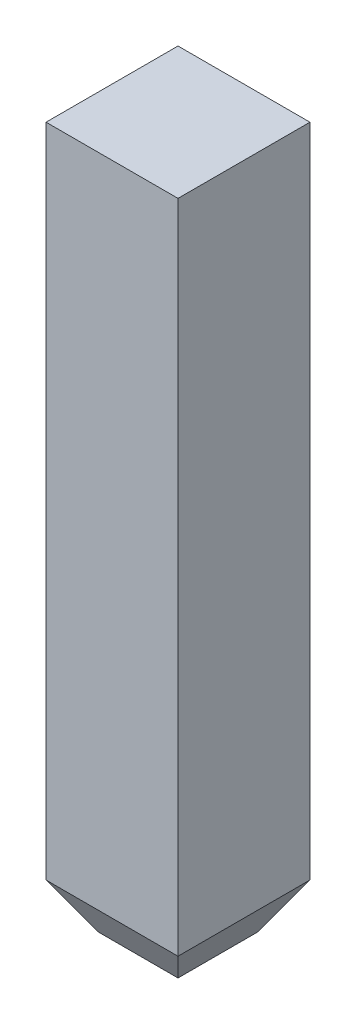
ISO-10303-21;
HEADER;
FILE_DESCRIPTION(('STEP AP214'),'2;1');
FILE_NAME('part.step','',(''),(''),'','','');
FILE_SCHEMA(('AUTOMOTIVE_DESIGN { 1 0 10303 214 1 1 1 1 }'));
ENDSEC;
DATA;
#1=APPLICATION_CONTEXT('core data for automotive mechanical design processes');
#2=APPLICATION_PROTOCOL_DEFINITION('international standard','automotive_design',2000,#1);
#3=PRODUCT_CONTEXT('',#1,'mechanical');
#4=PRODUCT('Part','Part','',(#3));
#5=PRODUCT_RELATED_PRODUCT_CATEGORY('part','',(#4));
#6=PRODUCT_DEFINITION_FORMATION('','',#4);
#7=PRODUCT_DEFINITION_CONTEXT('part definition',#1,'design');
#8=PRODUCT_DEFINITION('design','',#6,#7);
#9=PRODUCT_DEFINITION_SHAPE('','',#8);
#10=(LENGTH_UNIT() NAMED_UNIT(*) SI_UNIT(.MILLI.,.METRE.));
#11=(NAMED_UNIT(*) PLANE_ANGLE_UNIT() SI_UNIT($,.RADIAN.));
#12=(NAMED_UNIT(*) SI_UNIT($,.STERADIAN.) SOLID_ANGLE_UNIT());
#13=UNCERTAINTY_MEASURE_WITH_UNIT(LENGTH_MEASURE(1.E-05),#10,'distance_accuracy_value','');
#14=(GEOMETRIC_REPRESENTATION_CONTEXT(3) GLOBAL_UNCERTAINTY_ASSIGNED_CONTEXT((#13)) GLOBAL_UNIT_ASSIGNED_CONTEXT((#10,
#11,#12)) REPRESENTATION_CONTEXT('',''));
#15=CARTESIAN_POINT('',(0.,0.,0.));
#16=DIRECTION('',(0.,0.,1.));
#17=DIRECTION('',(1.,0.,0.));
#18=AXIS2_PLACEMENT_3D('',#15,#16,#17);
#19=CARTESIAN_POINT('',(-0.929999999999999,-3.4,0.82));
#20=DIRECTION('',(-1.,0.,0.));
#21=DIRECTION('',(0.,0.,1.));
#22=AXIS2_PLACEMENT_3D('',#19,#20,#21);
#23=PLANE('',#22);
#24=DIRECTION('',(0.,1.,0.));
#25=VECTOR('',#24,1.);
#26=CARTESIAN_POINT('',(-0.929999999999999,-3.4,0.82));
#27=LINE('',#26,#25);
#28=CARTESIAN_POINT('',(-0.929999999999999,-3.18349364905389,0.82));
#29=VERTEX_POINT('',#28);
#30=CARTESIAN_POINT('',(-0.929999999999999,0.,0.82));
#31=VERTEX_POINT('',#30);
#32=EDGE_CURVE('E11',#29,#31,#27,.T.);
#33=ORIENTED_EDGE('',*,*,#32,.F.);
#34=DIRECTION('',(0.,0.,-1.));
#35=VECTOR('',#34,1.);
#36=CARTESIAN_POINT('',(-0.929999999999999,-3.18349364905389,0.82));
#37=LINE('',#36,#35);
#38=CARTESIAN_POINT('',(-0.93,-3.18349364905389,0.18));
#39=VERTEX_POINT('',#38);
#40=EDGE_CURVE('E23',#29,#39,#37,.T.);
#41=ORIENTED_EDGE('',*,*,#40,.T.);
#42=DIRECTION('',(0.,1.,0.));
#43=VECTOR('',#42,1.);
#44=CARTESIAN_POINT('',(-0.93,-3.4,0.18));
#45=LINE('',#44,#43);
#46=CARTESIAN_POINT('',(-0.93,0.,0.18));
#47=VERTEX_POINT('',#46);
#48=EDGE_CURVE('E116',#39,#47,#45,.T.);
#49=ORIENTED_EDGE('',*,*,#48,.T.);
#50=DIRECTION('',(0.,0.,1.));
#51=VECTOR('',#50,1.);
#52=CARTESIAN_POINT('',(-0.929999999999999,0.,0.82));
#53=LINE('',#52,#51);
#54=EDGE_CURVE('E114',#47,#31,#53,.T.);
#55=ORIENTED_EDGE('',*,*,#54,.T.);
#56=EDGE_LOOP('',(#33,#41,#49,#55));
#57=FACE_BOUND('',#56,.T.);
#58=ADVANCED_FACE('F16',(#57),#23,.F.);
#59=CARTESIAN_POINT('',(-1.57,-3.4,0.82));
#60=DIRECTION('',(0.,0.,-1.));
#61=DIRECTION('',(-1.,0.,0.));
#62=AXIS2_PLACEMENT_3D('',#59,#60,#61);
#63=PLANE('',#62);
#64=DIRECTION('',(0.,1.,0.));
#65=VECTOR('',#64,1.);
#66=CARTESIAN_POINT('',(-1.57,-3.4,0.82));
#67=LINE('',#66,#65);
#68=CARTESIAN_POINT('',(-1.57,-3.18349364905389,0.82));
#69=VERTEX_POINT('',#68);
#70=CARTESIAN_POINT('',(-1.57,0.,0.82));
#71=VERTEX_POINT('',#70);
#72=EDGE_CURVE('E112',#69,#71,#67,.T.);
#73=ORIENTED_EDGE('',*,*,#72,.F.);
#74=DIRECTION('',(1.,0.,0.));
#75=VECTOR('',#74,1.);
#76=CARTESIAN_POINT('',(-1.57,-3.18349364905389,0.82));
#77=LINE('',#76,#75);
#78=EDGE_CURVE('E110',#69,#29,#77,.T.);
#79=ORIENTED_EDGE('',*,*,#78,.T.);
#80=ORIENTED_EDGE('',*,*,#32,.T.);
#81=DIRECTION('',(-1.,0.,0.));
#82=VECTOR('',#81,1.);
#83=CARTESIAN_POINT('',(-1.57,0.,0.82));
#84=LINE('',#83,#82);
#85=EDGE_CURVE('E108',#31,#71,#84,.T.);
#86=ORIENTED_EDGE('',*,*,#85,.T.);
#87=EDGE_LOOP('',(#73,#79,#80,#86));
#88=FACE_BOUND('',#87,.T.);
#89=ADVANCED_FACE('F138',(#88),#63,.F.);
#90=CARTESIAN_POINT('',(-1.57,-3.4,0.18));
#91=DIRECTION('',(1.,0.,0.));
#92=DIRECTION('',(0.,0.,-1.));
#93=AXIS2_PLACEMENT_3D('',#90,#91,#92);
#94=PLANE('',#93);
#95=DIRECTION('',(0.,1.,0.));
#96=VECTOR('',#95,1.);
#97=CARTESIAN_POINT('',(-1.57,-3.4,0.18));
#98=LINE('',#97,#96);
#99=CARTESIAN_POINT('',(-1.57,-3.18349364905389,0.18));
#100=VERTEX_POINT('',#99);
#101=CARTESIAN_POINT('',(-1.57,0.,0.18));
#102=VERTEX_POINT('',#101);
#103=EDGE_CURVE('E106',#100,#102,#98,.T.);
#104=ORIENTED_EDGE('',*,*,#103,.F.);
#105=DIRECTION('',(0.,0.,1.));
#106=VECTOR('',#105,1.);
#107=CARTESIAN_POINT('',(-1.57,-3.18349364905389,0.18));
#108=LINE('',#107,#106);
#109=EDGE_CURVE('E103',#100,#69,#108,.T.);
#110=ORIENTED_EDGE('',*,*,#109,.T.);
#111=ORIENTED_EDGE('',*,*,#72,.T.);
#112=DIRECTION('',(0.,0.,-1.));
#113=VECTOR('',#112,1.);
#114=CARTESIAN_POINT('',(-1.57,0.,0.18));
#115=LINE('',#114,#113);
#116=EDGE_CURVE('E100',#71,#102,#115,.T.);
#117=ORIENTED_EDGE('',*,*,#116,.T.);
#118=EDGE_LOOP('',(#104,#110,#111,#117));
#119=FACE_BOUND('',#118,.T.);
#120=ADVANCED_FACE('F133',(#119),#94,.F.);
#121=CARTESIAN_POINT('',(-0.93,-3.4,0.18));
#122=DIRECTION('',(0.,0.,1.));
#123=DIRECTION('',(1.,0.,0.));
#124=AXIS2_PLACEMENT_3D('',#121,#122,#123);
#125=PLANE('',#124);
#126=ORIENTED_EDGE('',*,*,#48,.F.);
#127=DIRECTION('',(-1.,0.,0.));
#128=VECTOR('',#127,1.);
#129=CARTESIAN_POINT('',(-0.93,-3.18349364905389,0.18));
#130=LINE('',#129,#128);
#131=EDGE_CURVE('E97',#39,#100,#130,.T.);
#132=ORIENTED_EDGE('',*,*,#131,.T.);
#133=ORIENTED_EDGE('',*,*,#103,.T.);
#134=DIRECTION('',(1.,0.,0.));
#135=VECTOR('',#134,1.);
#136=CARTESIAN_POINT('',(-0.93,0.,0.18));
#137=LINE('',#136,#135);
#138=EDGE_CURVE('E94',#102,#47,#137,.T.);
#139=ORIENTED_EDGE('',*,*,#138,.T.);
#140=EDGE_LOOP('',(#126,#132,#133,#139));
#141=FACE_BOUND('',#140,.T.);
#142=ADVANCED_FACE('F121',(#141),#125,.F.);
#143=CARTESIAN_POINT('',(0.,-3.4,0.));
#144=DIRECTION('',(0.,1.,0.));
#145=DIRECTION('',(0.,0.,1.));
#146=AXIS2_PLACEMENT_3D('',#143,#144,#145);
#147=PLANE('',#146);
#148=DIRECTION('',(0.,0.,-1.));
#149=VECTOR('',#148,1.);
#150=CARTESIAN_POINT('',(-1.445,-3.4,0.));
#151=LINE('',#150,#149);
#152=CARTESIAN_POINT('',(-1.445,-3.4,0.695));
#153=VERTEX_POINT('',#152);
#154=CARTESIAN_POINT('',(-1.445,-3.4,0.305));
#155=VERTEX_POINT('',#154);
#156=EDGE_CURVE('E92',#153,#155,#151,.T.);
#157=ORIENTED_EDGE('',*,*,#156,.T.);
#158=DIRECTION('',(1.,0.,0.));
#159=VECTOR('',#158,1.);
#160=CARTESIAN_POINT('',(0.,-3.4,0.305));
#161=LINE('',#160,#159);
#162=CARTESIAN_POINT('',(-1.055,-3.4,0.305));
#163=VERTEX_POINT('',#162);
#164=EDGE_CURVE('E71',#155,#163,#161,.T.);
#165=ORIENTED_EDGE('',*,*,#164,.T.);
#166=DIRECTION('',(0.,0.,1.));
#167=VECTOR('',#166,1.);
#168=CARTESIAN_POINT('',(-1.055,-3.4,0.));
#169=LINE('',#168,#167);
#170=CARTESIAN_POINT('',(-1.055,-3.4,0.695));
#171=VERTEX_POINT('',#170);
#172=EDGE_CURVE('E65',#163,#171,#169,.T.);
#173=ORIENTED_EDGE('',*,*,#172,.T.);
#174=DIRECTION('',(-1.,0.,0.));
#175=VECTOR('',#174,1.);
#176=CARTESIAN_POINT('',(0.,-3.4,0.695));
#177=LINE('',#176,#175);
#178=EDGE_CURVE('E68',#171,#153,#177,.T.);
#179=ORIENTED_EDGE('',*,*,#178,.T.);
#180=EDGE_LOOP('',(#157,#165,#173,#179));
#181=FACE_BOUND('',#180,.T.);
#182=ADVANCED_FACE('F67',(#181),#147,.F.);
#183=CARTESIAN_POINT('',(0.,0.,0.));
#184=DIRECTION('',(0.,1.,0.));
#185=DIRECTION('',(0.,0.,1.));
#186=AXIS2_PLACEMENT_3D('',#183,#184,#185);
#187=PLANE('',#186);
#188=ORIENTED_EDGE('',*,*,#54,.F.);
#189=ORIENTED_EDGE('',*,*,#138,.F.);
#190=ORIENTED_EDGE('',*,*,#116,.F.);
#191=ORIENTED_EDGE('',*,*,#85,.F.);
#192=EDGE_LOOP('',(#188,#189,#190,#191));
#193=FACE_BOUND('',#192,.T.);
#194=ADVANCED_FACE('F137',(#193),#187,.T.);
#195=CARTESIAN_POINT('',(0.,-3.4,0.695));
#196=DIRECTION('',(0.,0.500000000000001,-0.866025403784438));
#197=DIRECTION('',(-1.,0.,0.));
#198=AXIS2_PLACEMENT_3D('',#195,#196,#197);
#199=PLANE('',#198);
#200=DIRECTION('',(-0.447213595499959,-0.774596669241483,-0.447213595499959));
#201=VECTOR('',#200,1.);
#202=CARTESIAN_POINT('',(-1.194,-3.64075506225208,0.555999999999999));
#203=LINE('',#202,#201);
#204=EDGE_CURVE('E81',#29,#171,#203,.T.);
#205=ORIENTED_EDGE('',*,*,#204,.F.);
#206=ORIENTED_EDGE('',*,*,#78,.F.);
#207=DIRECTION('',(-0.447213595499959,0.774596669241483,0.447213595499959));
#208=VECTOR('',#207,1.);
#209=CARTESIAN_POINT('',(-1.156,-3.90056268338741,0.405999999999999));
#210=LINE('',#209,#208);
#211=EDGE_CURVE('E83',#153,#69,#210,.T.);
#212=ORIENTED_EDGE('',*,*,#211,.F.);
#213=ORIENTED_EDGE('',*,*,#178,.F.);
#214=EDGE_LOOP('',(#205,#206,#212,#213));
#215=FACE_BOUND('',#214,.T.);
#216=ADVANCED_FACE('F79',(#215),#199,.F.);
#217=CARTESIAN_POINT('',(-1.445,-3.4,0.));
#218=DIRECTION('',(0.866025403784438,0.500000000000001,0.));
#219=DIRECTION('',(0.,0.,-1.));
#220=AXIS2_PLACEMENT_3D('',#217,#218,#219);
#221=PLANE('',#220);
#222=ORIENTED_EDGE('',*,*,#211,.T.);
#223=ORIENTED_EDGE('',*,*,#109,.F.);
#224=DIRECTION('',(-0.447213595499959,0.774596669241483,-0.447213595499959));
#225=VECTOR('',#224,1.);
#226=CARTESIAN_POINT('',(-1.506,-3.2943449007383,0.244));
#227=LINE('',#226,#225);
#228=EDGE_CURVE('E87',#155,#100,#227,.T.);
#229=ORIENTED_EDGE('',*,*,#228,.F.);
#230=ORIENTED_EDGE('',*,*,#156,.F.);
#231=EDGE_LOOP('',(#222,#223,#229,#230));
#232=FACE_BOUND('',#231,.T.);
#233=ADVANCED_FACE('F131',(#232),#221,.F.);
#234=CARTESIAN_POINT('',(-1.055,-3.4,0.));
#235=DIRECTION('',(-0.866025403784438,0.500000000000001,0.));
#236=DIRECTION('',(0.,0.,1.));
#237=AXIS2_PLACEMENT_3D('',#234,#235,#236);
#238=PLANE('',#237);
#239=ORIENTED_EDGE('',*,*,#204,.T.);
#240=ORIENTED_EDGE('',*,*,#172,.F.);
#241=DIRECTION('',(-0.447213595499958,-0.774596669241483,0.447213595499959));
#242=VECTOR('',#241,1.);
#243=CARTESIAN_POINT('',(-0.994000000000001,-3.2943449007383,0.244));
#244=LINE('',#243,#242);
#245=EDGE_CURVE('E126',#39,#163,#244,.T.);
#246=ORIENTED_EDGE('',*,*,#245,.F.);
#247=ORIENTED_EDGE('',*,*,#40,.F.);
#248=EDGE_LOOP('',(#239,#240,#246,#247));
#249=FACE_BOUND('',#248,.T.);
#250=ADVANCED_FACE('F85',(#249),#238,.F.);
#251=CARTESIAN_POINT('',(0.,-3.4,0.305));
#252=DIRECTION('',(0.,0.500000000000001,0.866025403784438));
#253=DIRECTION('',(1.,0.,0.));
#254=AXIS2_PLACEMENT_3D('',#251,#252,#253);
#255=PLANE('',#254);
#256=ORIENTED_EDGE('',*,*,#228,.T.);
#257=ORIENTED_EDGE('',*,*,#131,.F.);
#258=ORIENTED_EDGE('',*,*,#245,.T.);
#259=ORIENTED_EDGE('',*,*,#164,.F.);
#260=EDGE_LOOP('',(#256,#257,#258,#259));
#261=FACE_BOUND('',#260,.T.);
#262=ADVANCED_FACE('F125',(#261),#255,.F.);
#263=CLOSED_SHELL('',(#58,#89,#120,#142,#182,#194,#216,#233,#250,#262));
#264=MANIFOLD_SOLID_BREP('B1',#263);
#265=ADVANCED_BREP_SHAPE_REPRESENTATION('',(#18,#264),#14);
#266=SHAPE_DEFINITION_REPRESENTATION(#9,#265);
ENDSEC;
END-ISO-10303-21;
